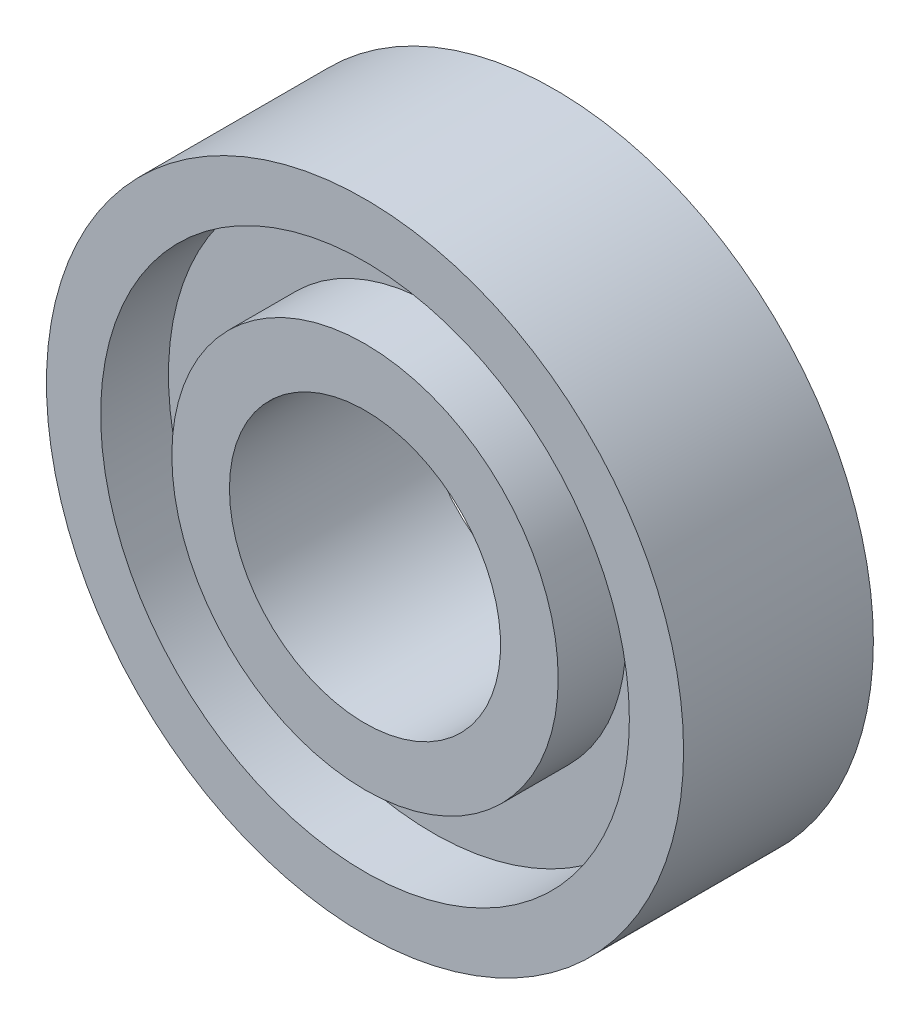
ISO-10303-21;
HEADER;
FILE_DESCRIPTION(('STEP AP214'),'2;1');
FILE_NAME('part.step','',(''),(''),'','','');
FILE_SCHEMA(('AUTOMOTIVE_DESIGN { 1 0 10303 214 1 1 1 1 }'));
ENDSEC;
DATA;
#1=APPLICATION_CONTEXT('core data for automotive mechanical design processes');
#2=APPLICATION_PROTOCOL_DEFINITION('international standard','automotive_design',2000,#1);
#3=PRODUCT_CONTEXT('',#1,'mechanical');
#4=PRODUCT('Part','Part','',(#3));
#5=PRODUCT_RELATED_PRODUCT_CATEGORY('part','',(#4));
#6=PRODUCT_DEFINITION_FORMATION('','',#4);
#7=PRODUCT_DEFINITION_CONTEXT('part definition',#1,'design');
#8=PRODUCT_DEFINITION('design','',#6,#7);
#9=PRODUCT_DEFINITION_SHAPE('','',#8);
#10=(LENGTH_UNIT() NAMED_UNIT(*) SI_UNIT(.MILLI.,.METRE.));
#11=(NAMED_UNIT(*) PLANE_ANGLE_UNIT() SI_UNIT($,.RADIAN.));
#12=(NAMED_UNIT(*) SI_UNIT($,.STERADIAN.) SOLID_ANGLE_UNIT());
#13=UNCERTAINTY_MEASURE_WITH_UNIT(LENGTH_MEASURE(1.E-05),#10,'distance_accuracy_value','');
#14=(GEOMETRIC_REPRESENTATION_CONTEXT(3) GLOBAL_UNCERTAINTY_ASSIGNED_CONTEXT((#13)) GLOBAL_UNIT_ASSIGNED_CONTEXT((#10,
#11,#12)) REPRESENTATION_CONTEXT('',''));
#15=CARTESIAN_POINT('',(0.,0.,0.));
#16=DIRECTION('',(0.,0.,1.));
#17=DIRECTION('',(1.,0.,0.));
#18=AXIS2_PLACEMENT_3D('',#15,#16,#17);
#19=CARTESIAN_POINT('',(0.,0.,14.));
#20=DIRECTION('',(0.,0.,-1.));
#21=DIRECTION('',(-1.,0.,0.));
#22=AXIS2_PLACEMENT_3D('',#19,#20,#21);
#23=CYLINDRICAL_SURFACE('',#22,23.5);
#24=CARTESIAN_POINT('',(0.,0.,14.));
#25=DIRECTION('',(0.,0.,1.));
#26=DIRECTION('',(1.,0.,0.));
#27=AXIS2_PLACEMENT_3D('',#24,#25,#26);
#28=CIRCLE('',#27,23.5);
#29=CARTESIAN_POINT('',(23.5,0.,14.));
#30=VERTEX_POINT('',#29);
#31=EDGE_CURVE('E10',#30,#30,#28,.T.);
#32=ORIENTED_EDGE('',*,*,#31,.F.);
#33=EDGE_LOOP('',(#32));
#34=FACE_BOUND('',#33,.T.);
#35=CARTESIAN_POINT('',(0.,0.,0.));
#36=DIRECTION('',(0.,0.,1.));
#37=DIRECTION('',(1.,0.,0.));
#38=AXIS2_PLACEMENT_3D('',#35,#36,#37);
#39=CIRCLE('',#38,23.5);
#40=CARTESIAN_POINT('',(23.5,0.,0.));
#41=VERTEX_POINT('',#40);
#42=EDGE_CURVE('E33',#41,#41,#39,.T.);
#43=ORIENTED_EDGE('',*,*,#42,.T.);
#44=EDGE_LOOP('',(#43));
#45=FACE_BOUND('',#44,.T.);
#46=ADVANCED_FACE('F30',(#34,#45),#23,.T.);
#47=CARTESIAN_POINT('',(0.,0.,14.));
#48=DIRECTION('',(0.,0.,1.));
#49=DIRECTION('',(1.,0.,0.));
#50=AXIS2_PLACEMENT_3D('',#47,#48,#49);
#51=PLANE('',#50);
#52=CARTESIAN_POINT('',(0.,0.,14.));
#53=DIRECTION('',(0.,0.,1.));
#54=DIRECTION('',(1.,0.,0.));
#55=AXIS2_PLACEMENT_3D('',#52,#53,#54);
#56=CIRCLE('',#55,19.5);
#57=CARTESIAN_POINT('',(19.5,0.,14.));
#58=VERTEX_POINT('',#57);
#59=EDGE_CURVE('E42',#58,#58,#56,.T.);
#60=ORIENTED_EDGE('',*,*,#59,.F.);
#61=EDGE_LOOP('',(#60));
#62=FACE_BOUND('',#61,.T.);
#63=ORIENTED_EDGE('',*,*,#31,.T.);
#64=EDGE_LOOP('',(#63));
#65=FACE_BOUND('',#64,.T.);
#66=ADVANCED_FACE('F99',(#62,#65),#51,.T.);
#67=CARTESIAN_POINT('',(0.,0.,0.));
#68=DIRECTION('',(0.,0.,1.));
#69=DIRECTION('',(1.,0.,0.));
#70=AXIS2_PLACEMENT_3D('',#67,#68,#69);
#71=PLANE('',#70);
#72=CARTESIAN_POINT('',(0.,0.,0.));
#73=DIRECTION('',(0.,0.,-1.));
#74=DIRECTION('',(-1.,0.,0.));
#75=AXIS2_PLACEMENT_3D('',#72,#73,#74);
#76=CIRCLE('',#75,19.5);
#77=CARTESIAN_POINT('',(-19.5,0.,0.));
#78=VERTEX_POINT('',#77);
#79=EDGE_CURVE('E54',#78,#78,#76,.T.);
#80=ORIENTED_EDGE('',*,*,#79,.F.);
#81=EDGE_LOOP('',(#80));
#82=FACE_BOUND('',#81,.T.);
#83=ORIENTED_EDGE('',*,*,#42,.F.);
#84=EDGE_LOOP('',(#83));
#85=FACE_BOUND('',#84,.T.);
#86=ADVANCED_FACE('F85',(#82,#85),#71,.F.);
#87=CARTESIAN_POINT('',(0.,0.,9.));
#88=DIRECTION('',(0.,0.,1.));
#89=DIRECTION('',(1.,0.,0.));
#90=AXIS2_PLACEMENT_3D('',#87,#88,#89);
#91=CYLINDRICAL_SURFACE('',#90,19.5);
#92=CARTESIAN_POINT('',(0.,0.,9.));
#93=DIRECTION('',(0.,0.,1.));
#94=DIRECTION('',(1.,0.,0.));
#95=AXIS2_PLACEMENT_3D('',#92,#93,#94);
#96=CIRCLE('',#95,19.5);
#97=CARTESIAN_POINT('',(19.5,0.,9.));
#98=VERTEX_POINT('',#97);
#99=EDGE_CURVE('E40',#98,#98,#96,.T.);
#100=ORIENTED_EDGE('',*,*,#99,.F.);
#101=EDGE_LOOP('',(#100));
#102=FACE_BOUND('',#101,.T.);
#103=ORIENTED_EDGE('',*,*,#59,.T.);
#104=EDGE_LOOP('',(#103));
#105=FACE_BOUND('',#104,.T.);
#106=ADVANCED_FACE('F110',(#102,#105),#91,.F.);
#107=CARTESIAN_POINT('',(0.,0.,9.));
#108=DIRECTION('',(0.,0.,1.));
#109=DIRECTION('',(1.,0.,0.));
#110=AXIS2_PLACEMENT_3D('',#107,#108,#109);
#111=PLANE('',#110);
#112=CARTESIAN_POINT('',(0.,0.,9.));
#113=DIRECTION('',(0.,0.,1.));
#114=DIRECTION('',(1.,0.,0.));
#115=AXIS2_PLACEMENT_3D('',#112,#113,#114);
#116=CIRCLE('',#115,14.25);
#117=CARTESIAN_POINT('',(14.25,0.,9.));
#118=VERTEX_POINT('',#117);
#119=EDGE_CURVE('E45',#118,#118,#116,.T.);
#120=ORIENTED_EDGE('',*,*,#119,.F.);
#121=EDGE_LOOP('',(#120));
#122=FACE_BOUND('',#121,.T.);
#123=ORIENTED_EDGE('',*,*,#99,.T.);
#124=EDGE_LOOP('',(#123));
#125=FACE_BOUND('',#124,.T.);
#126=ADVANCED_FACE('F115',(#122,#125),#111,.T.);
#127=CARTESIAN_POINT('',(0.,0.,9.));
#128=DIRECTION('',(0.,0.,1.));
#129=DIRECTION('',(1.,0.,0.));
#130=AXIS2_PLACEMENT_3D('',#127,#128,#129);
#131=CYLINDRICAL_SURFACE('',#130,14.25);
#132=ORIENTED_EDGE('',*,*,#119,.T.);
#133=EDGE_LOOP('',(#132));
#134=FACE_BOUND('',#133,.T.);
#135=CARTESIAN_POINT('',(0.,0.,14.));
#136=DIRECTION('',(0.,0.,1.));
#137=DIRECTION('',(1.,0.,0.));
#138=AXIS2_PLACEMENT_3D('',#135,#136,#137);
#139=CIRCLE('',#138,14.25);
#140=CARTESIAN_POINT('',(14.25,0.,14.));
#141=VERTEX_POINT('',#140);
#142=EDGE_CURVE('E48',#141,#141,#139,.T.);
#143=ORIENTED_EDGE('',*,*,#142,.F.);
#144=EDGE_LOOP('',(#143));
#145=FACE_BOUND('',#144,.T.);
#146=ADVANCED_FACE('F122',(#134,#145),#131,.T.);
#147=CARTESIAN_POINT('',(0.,0.,14.));
#148=DIRECTION('',(0.,0.,-1.));
#149=DIRECTION('',(-1.,0.,0.));
#150=AXIS2_PLACEMENT_3D('',#147,#148,#149);
#151=CIRCLE('',#150,10.);
#152=CARTESIAN_POINT('',(-10.,0.,14.));
#153=VERTEX_POINT('',#152);
#154=EDGE_CURVE('E63',#153,#153,#151,.T.);
#155=ORIENTED_EDGE('',*,*,#154,.T.);
#156=EDGE_LOOP('',(#155));
#157=FACE_BOUND('',#156,.T.);
#158=ORIENTED_EDGE('',*,*,#142,.T.);
#159=EDGE_LOOP('',(#158));
#160=FACE_BOUND('',#159,.T.);
#161=ADVANCED_FACE('F72',(#157,#160),#51,.T.);
#162=CARTESIAN_POINT('',(0.,0.,5.));
#163=DIRECTION('',(0.,0.,-1.));
#164=DIRECTION('',(-1.,0.,0.));
#165=AXIS2_PLACEMENT_3D('',#162,#163,#164);
#166=CYLINDRICAL_SURFACE('',#165,19.5);
#167=CARTESIAN_POINT('',(0.,0.,5.));
#168=DIRECTION('',(0.,0.,-1.));
#169=DIRECTION('',(-1.,0.,0.));
#170=AXIS2_PLACEMENT_3D('',#167,#168,#169);
#171=CIRCLE('',#170,19.5);
#172=CARTESIAN_POINT('',(-19.5,0.,5.));
#173=VERTEX_POINT('',#172);
#174=EDGE_CURVE('E51',#173,#173,#171,.T.);
#175=ORIENTED_EDGE('',*,*,#174,.F.);
#176=EDGE_LOOP('',(#175));
#177=FACE_BOUND('',#176,.T.);
#178=ORIENTED_EDGE('',*,*,#79,.T.);
#179=EDGE_LOOP('',(#178));
#180=FACE_BOUND('',#179,.T.);
#181=ADVANCED_FACE('F95',(#177,#180),#166,.F.);
#182=CARTESIAN_POINT('',(0.,0.,5.));
#183=DIRECTION('',(0.,0.,-1.));
#184=DIRECTION('',(-1.,0.,0.));
#185=AXIS2_PLACEMENT_3D('',#182,#183,#184);
#186=PLANE('',#185);
#187=CARTESIAN_POINT('',(0.,0.,5.));
#188=DIRECTION('',(0.,0.,-1.));
#189=DIRECTION('',(-1.,0.,0.));
#190=AXIS2_PLACEMENT_3D('',#187,#188,#189);
#191=CIRCLE('',#190,14.25);
#192=CARTESIAN_POINT('',(-14.25,0.,5.));
#193=VERTEX_POINT('',#192);
#194=EDGE_CURVE('E57',#193,#193,#191,.T.);
#195=ORIENTED_EDGE('',*,*,#194,.F.);
#196=EDGE_LOOP('',(#195));
#197=FACE_BOUND('',#196,.T.);
#198=ORIENTED_EDGE('',*,*,#174,.T.);
#199=EDGE_LOOP('',(#198));
#200=FACE_BOUND('',#199,.T.);
#201=ADVANCED_FACE('F89',(#197,#200),#186,.T.);
#202=CARTESIAN_POINT('',(0.,0.,5.));
#203=DIRECTION('',(0.,0.,-1.));
#204=DIRECTION('',(-1.,0.,0.));
#205=AXIS2_PLACEMENT_3D('',#202,#203,#204);
#206=CYLINDRICAL_SURFACE('',#205,14.25);
#207=ORIENTED_EDGE('',*,*,#194,.T.);
#208=EDGE_LOOP('',(#207));
#209=FACE_BOUND('',#208,.T.);
#210=CARTESIAN_POINT('',(0.,0.,0.));
#211=DIRECTION('',(0.,0.,-1.));
#212=DIRECTION('',(-1.,0.,0.));
#213=AXIS2_PLACEMENT_3D('',#210,#211,#212);
#214=CIRCLE('',#213,14.25);
#215=CARTESIAN_POINT('',(-14.25,0.,0.));
#216=VERTEX_POINT('',#215);
#217=EDGE_CURVE('E60',#216,#216,#214,.T.);
#218=ORIENTED_EDGE('',*,*,#217,.F.);
#219=EDGE_LOOP('',(#218));
#220=FACE_BOUND('',#219,.T.);
#221=ADVANCED_FACE('F84',(#209,#220),#206,.T.);
#222=CARTESIAN_POINT('',(0.,0.,0.));
#223=DIRECTION('',(0.,0.,-1.));
#224=DIRECTION('',(-1.,0.,0.));
#225=AXIS2_PLACEMENT_3D('',#222,#223,#224);
#226=CIRCLE('',#225,10.);
#227=CARTESIAN_POINT('',(-10.,0.,0.));
#228=VERTEX_POINT('',#227);
#229=EDGE_CURVE('E66',#228,#228,#226,.T.);
#230=ORIENTED_EDGE('',*,*,#229,.F.);
#231=EDGE_LOOP('',(#230));
#232=FACE_BOUND('',#231,.T.);
#233=ORIENTED_EDGE('',*,*,#217,.T.);
#234=EDGE_LOOP('',(#233));
#235=FACE_BOUND('',#234,.T.);
#236=ADVANCED_FACE('F78',(#232,#235),#71,.F.);
#237=CARTESIAN_POINT('',(0.,0.,14.));
#238=DIRECTION('',(0.,0.,-1.));
#239=DIRECTION('',(-1.,0.,0.));
#240=AXIS2_PLACEMENT_3D('',#237,#238,#239);
#241=CYLINDRICAL_SURFACE('',#240,10.);
#242=ORIENTED_EDGE('',*,*,#154,.F.);
#243=EDGE_LOOP('',(#242));
#244=FACE_BOUND('',#243,.T.);
#245=ORIENTED_EDGE('',*,*,#229,.T.);
#246=EDGE_LOOP('',(#245));
#247=FACE_BOUND('',#246,.T.);
#248=ADVANCED_FACE('F75',(#244,#247),#241,.F.);
#249=CLOSED_SHELL('',(#46,#66,#86,#106,#126,#146,#161,#181,#201,#221,#236,#248));
#250=MANIFOLD_SOLID_BREP('B2',#249);
#251=ADVANCED_BREP_SHAPE_REPRESENTATION('',(#18,#250),#14);
#252=SHAPE_DEFINITION_REPRESENTATION(#9,#251);
ENDSEC;
END-ISO-10303-21;
